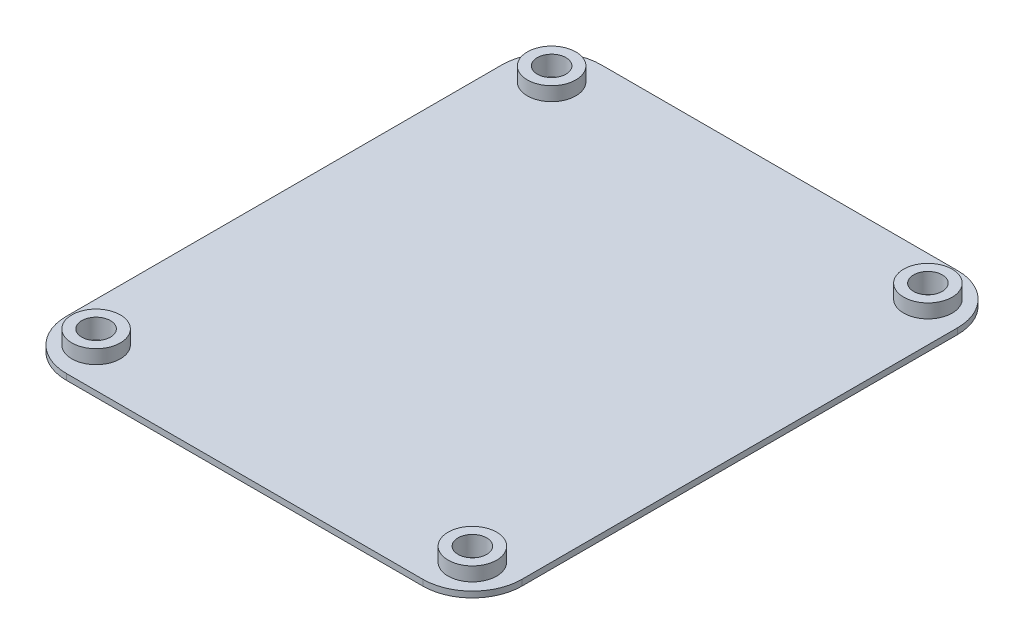
ISO-10303-21;
HEADER;
FILE_DESCRIPTION(('STEP AP214'),'2;1');
FILE_NAME('part.step','',(''),(''),'','','');
FILE_SCHEMA(('AUTOMOTIVE_DESIGN { 1 0 10303 214 1 1 1 1 }'));
ENDSEC;
DATA;
#1=APPLICATION_CONTEXT('core data for automotive mechanical design processes');
#2=APPLICATION_PROTOCOL_DEFINITION('international standard','automotive_design',2000,#1);
#3=PRODUCT_CONTEXT('',#1,'mechanical');
#4=PRODUCT('Part','Part','',(#3));
#5=PRODUCT_RELATED_PRODUCT_CATEGORY('part','',(#4));
#6=PRODUCT_DEFINITION_FORMATION('','',#4);
#7=PRODUCT_DEFINITION_CONTEXT('part definition',#1,'design');
#8=PRODUCT_DEFINITION('design','',#6,#7);
#9=PRODUCT_DEFINITION_SHAPE('','',#8);
#10=(LENGTH_UNIT() NAMED_UNIT(*) SI_UNIT(.MILLI.,.METRE.));
#11=(NAMED_UNIT(*) PLANE_ANGLE_UNIT() SI_UNIT($,.RADIAN.));
#12=(NAMED_UNIT(*) SI_UNIT($,.STERADIAN.) SOLID_ANGLE_UNIT());
#13=UNCERTAINTY_MEASURE_WITH_UNIT(LENGTH_MEASURE(1.E-05),#10,'distance_accuracy_value','');
#14=(GEOMETRIC_REPRESENTATION_CONTEXT(3) GLOBAL_UNCERTAINTY_ASSIGNED_CONTEXT((#13)) GLOBAL_UNIT_ASSIGNED_CONTEXT((#10,
#11,#12)) REPRESENTATION_CONTEXT('',''));
#15=CARTESIAN_POINT('',(0.,0.,0.));
#16=DIRECTION('',(0.,0.,1.));
#17=DIRECTION('',(1.,0.,0.));
#18=AXIS2_PLACEMENT_3D('',#15,#16,#17);
#19=CARTESIAN_POINT('',(0.,0.6,-27.));
#20=DIRECTION('',(0.,0.,-1.));
#21=DIRECTION('',(-1.,0.,0.));
#22=AXIS2_PLACEMENT_3D('',#19,#20,#21);
#23=PLANE('',#22);
#24=DIRECTION('',(1.,0.,0.));
#25=VECTOR('',#24,1.);
#26=CARTESIAN_POINT('',(0.,0.,-27.));
#27=LINE('',#26,#25);
#28=CARTESIAN_POINT('',(-18.,0.,-27.));
#29=VERTEX_POINT('',#28);
#30=CARTESIAN_POINT('',(18.,0.,-27.));
#31=VERTEX_POINT('',#30);
#32=EDGE_CURVE('E131',#29,#31,#27,.T.);
#33=ORIENTED_EDGE('',*,*,#32,.F.);
#34=DIRECTION('',(0.,-1.,0.));
#35=VECTOR('',#34,1.);
#36=CARTESIAN_POINT('',(-18.,0.6,-27.));
#37=LINE('',#36,#35);
#38=CARTESIAN_POINT('',(-18.,0.6,-27.));
#39=VERTEX_POINT('',#38);
#40=EDGE_CURVE('E107',#29,#39,#37,.F.);
#41=ORIENTED_EDGE('',*,*,#40,.T.);
#42=DIRECTION('',(1.,0.,0.));
#43=VECTOR('',#42,1.);
#44=CARTESIAN_POINT('',(0.,0.6,-27.));
#45=LINE('',#44,#43);
#46=CARTESIAN_POINT('',(18.,0.6,-27.));
#47=VERTEX_POINT('',#46);
#48=EDGE_CURVE('E154',#39,#47,#45,.T.);
#49=ORIENTED_EDGE('',*,*,#48,.T.);
#50=DIRECTION('',(0.,-1.,0.));
#51=VECTOR('',#50,1.);
#52=CARTESIAN_POINT('',(18.,0.6,-27.));
#53=LINE('',#52,#51);
#54=EDGE_CURVE('E112',#47,#31,#53,.T.);
#55=ORIENTED_EDGE('',*,*,#54,.T.);
#56=EDGE_LOOP('',(#33,#41,#49,#55));
#57=FACE_BOUND('',#56,.T.);
#58=ADVANCED_FACE('F35',(#57),#23,.T.);
#59=CARTESIAN_POINT('',(-23.,0.6,0.));
#60=DIRECTION('',(1.,0.,0.));
#61=DIRECTION('',(0.,0.,-1.));
#62=AXIS2_PLACEMENT_3D('',#59,#60,#61);
#63=PLANE('',#62);
#64=DIRECTION('',(0.,0.,1.));
#65=VECTOR('',#64,1.);
#66=CARTESIAN_POINT('',(-23.,0.6,0.));
#67=LINE('',#66,#65);
#68=CARTESIAN_POINT('',(-23.,0.6,-22.));
#69=VERTEX_POINT('',#68);
#70=CARTESIAN_POINT('',(-23.,0.6,22.));
#71=VERTEX_POINT('',#70);
#72=EDGE_CURVE('E122',#69,#71,#67,.T.);
#73=ORIENTED_EDGE('',*,*,#72,.F.);
#74=DIRECTION('',(0.,-1.,0.));
#75=VECTOR('',#74,1.);
#76=CARTESIAN_POINT('',(-23.,0.,-22.));
#77=LINE('',#76,#75);
#78=CARTESIAN_POINT('',(-23.,0.,-22.));
#79=VERTEX_POINT('',#78);
#80=EDGE_CURVE('E106',#69,#79,#77,.T.);
#81=ORIENTED_EDGE('',*,*,#80,.T.);
#82=DIRECTION('',(0.,0.,1.));
#83=VECTOR('',#82,1.);
#84=CARTESIAN_POINT('',(-23.,0.,0.));
#85=LINE('',#84,#83);
#86=CARTESIAN_POINT('',(-23.,0.,22.));
#87=VERTEX_POINT('',#86);
#88=EDGE_CURVE('E119',#79,#87,#85,.T.);
#89=ORIENTED_EDGE('',*,*,#88,.T.);
#90=DIRECTION('',(0.,-1.,0.));
#91=VECTOR('',#90,1.);
#92=CARTESIAN_POINT('',(-23.,0.6,22.));
#93=LINE('',#92,#91);
#94=EDGE_CURVE('E124',#87,#71,#93,.F.);
#95=ORIENTED_EDGE('',*,*,#94,.T.);
#96=EDGE_LOOP('',(#73,#81,#89,#95));
#97=FACE_BOUND('',#96,.T.);
#98=ADVANCED_FACE('F118',(#97),#63,.F.);
#99=CARTESIAN_POINT('',(0.,0.6,27.));
#100=DIRECTION('',(0.,0.,-1.));
#101=DIRECTION('',(-1.,0.,0.));
#102=AXIS2_PLACEMENT_3D('',#99,#100,#101);
#103=PLANE('',#102);
#104=DIRECTION('',(1.,0.,0.));
#105=VECTOR('',#104,1.);
#106=CARTESIAN_POINT('',(0.,0.6,27.));
#107=LINE('',#106,#105);
#108=CARTESIAN_POINT('',(-18.,0.6,27.));
#109=VERTEX_POINT('',#108);
#110=CARTESIAN_POINT('',(18.,0.6,27.));
#111=VERTEX_POINT('',#110);
#112=EDGE_CURVE('E177',#109,#111,#107,.T.);
#113=ORIENTED_EDGE('',*,*,#112,.F.);
#114=DIRECTION('',(0.,-1.,0.));
#115=VECTOR('',#114,1.);
#116=CARTESIAN_POINT('',(-18.,0.6,27.));
#117=LINE('',#116,#115);
#118=CARTESIAN_POINT('',(-18.,0.,27.));
#119=VERTEX_POINT('',#118);
#120=EDGE_CURVE('E11',#109,#119,#117,.T.);
#121=ORIENTED_EDGE('',*,*,#120,.T.);
#122=DIRECTION('',(1.,0.,0.));
#123=VECTOR('',#122,1.);
#124=CARTESIAN_POINT('',(0.,0.,27.));
#125=LINE('',#124,#123);
#126=CARTESIAN_POINT('',(18.,0.,27.));
#127=VERTEX_POINT('',#126);
#128=EDGE_CURVE('E130',#119,#127,#125,.T.);
#129=ORIENTED_EDGE('',*,*,#128,.T.);
#130=DIRECTION('',(0.,-1.,0.));
#131=VECTOR('',#130,1.);
#132=CARTESIAN_POINT('',(18.,0.6,27.));
#133=LINE('',#132,#131);
#134=EDGE_CURVE('E43',#127,#111,#133,.F.);
#135=ORIENTED_EDGE('',*,*,#134,.T.);
#136=EDGE_LOOP('',(#113,#121,#129,#135));
#137=FACE_BOUND('',#136,.T.);
#138=ADVANCED_FACE('F176',(#137),#103,.F.);
#139=CARTESIAN_POINT('',(-19.,0.6,23.));
#140=DIRECTION('',(0.,-1.,0.));
#141=DIRECTION('',(0.,0.,-1.));
#142=AXIS2_PLACEMENT_3D('',#139,#140,#141);
#143=CYLINDRICAL_SURFACE('',#142,1.45);
#144=CARTESIAN_POINT('',(-19.,0.,23.));
#145=DIRECTION('',(0.,1.,0.));
#146=DIRECTION('',(0.,0.,1.));
#147=AXIS2_PLACEMENT_3D('',#144,#145,#146);
#148=CIRCLE('',#147,1.45);
#149=CARTESIAN_POINT('',(-19.,0.,24.45));
#150=VERTEX_POINT('',#149);
#151=EDGE_CURVE('E148',#150,#150,#148,.T.);
#152=ORIENTED_EDGE('',*,*,#151,.F.);
#153=EDGE_LOOP('',(#152));
#154=FACE_BOUND('',#153,.T.);
#155=CARTESIAN_POINT('',(-19.,2.,23.));
#156=DIRECTION('',(0.,1.,0.));
#157=DIRECTION('',(0.,0.,1.));
#158=AXIS2_PLACEMENT_3D('',#155,#156,#157);
#159=CIRCLE('',#158,1.45);
#160=CARTESIAN_POINT('',(-19.,2.,24.45));
#161=VERTEX_POINT('',#160);
#162=EDGE_CURVE('E200',#161,#161,#159,.T.);
#163=ORIENTED_EDGE('',*,*,#162,.T.);
#164=EDGE_LOOP('',(#163));
#165=FACE_BOUND('',#164,.T.);
#166=ADVANCED_FACE('F333',(#154,#165),#143,.F.);
#167=CARTESIAN_POINT('',(19.,0.6,-23.));
#168=DIRECTION('',(0.,-1.,0.));
#169=DIRECTION('',(0.,0.,-1.));
#170=AXIS2_PLACEMENT_3D('',#167,#168,#169);
#171=CYLINDRICAL_SURFACE('',#170,1.45);
#172=CARTESIAN_POINT('',(19.,0.,-23.));
#173=DIRECTION('',(0.,1.,0.));
#174=DIRECTION('',(0.,0.,1.));
#175=AXIS2_PLACEMENT_3D('',#172,#173,#174);
#176=CIRCLE('',#175,1.45);
#177=CARTESIAN_POINT('',(19.,0.,-21.55));
#178=VERTEX_POINT('',#177);
#179=EDGE_CURVE('E145',#178,#178,#176,.T.);
#180=ORIENTED_EDGE('',*,*,#179,.F.);
#181=EDGE_LOOP('',(#180));
#182=FACE_BOUND('',#181,.T.);
#183=CARTESIAN_POINT('',(19.,2.,-23.));
#184=DIRECTION('',(0.,1.,0.));
#185=DIRECTION('',(0.,0.,1.));
#186=AXIS2_PLACEMENT_3D('',#183,#184,#185);
#187=CIRCLE('',#186,1.45);
#188=CARTESIAN_POINT('',(19.,2.,-21.55));
#189=VERTEX_POINT('',#188);
#190=EDGE_CURVE('E227',#189,#189,#187,.T.);
#191=ORIENTED_EDGE('',*,*,#190,.T.);
#192=EDGE_LOOP('',(#191));
#193=FACE_BOUND('',#192,.T.);
#194=ADVANCED_FACE('F231',(#182,#193),#171,.F.);
#195=CARTESIAN_POINT('',(-19.,0.6,-23.));
#196=DIRECTION('',(0.,-1.,0.));
#197=DIRECTION('',(0.,0.,-1.));
#198=AXIS2_PLACEMENT_3D('',#195,#196,#197);
#199=CYLINDRICAL_SURFACE('',#198,1.45);
#200=CARTESIAN_POINT('',(-19.,0.,-23.));
#201=DIRECTION('',(0.,1.,0.));
#202=DIRECTION('',(0.,0.,1.));
#203=AXIS2_PLACEMENT_3D('',#200,#201,#202);
#204=CIRCLE('',#203,1.45);
#205=CARTESIAN_POINT('',(-19.,0.,-21.55));
#206=VERTEX_POINT('',#205);
#207=EDGE_CURVE('E142',#206,#206,#204,.T.);
#208=ORIENTED_EDGE('',*,*,#207,.F.);
#209=EDGE_LOOP('',(#208));
#210=FACE_BOUND('',#209,.T.);
#211=CARTESIAN_POINT('',(-19.,2.,-23.));
#212=DIRECTION('',(0.,1.,0.));
#213=DIRECTION('',(0.,0.,1.));
#214=AXIS2_PLACEMENT_3D('',#211,#212,#213);
#215=CIRCLE('',#214,1.45);
#216=CARTESIAN_POINT('',(-19.,2.,-21.55));
#217=VERTEX_POINT('',#216);
#218=EDGE_CURVE('E218',#217,#217,#215,.T.);
#219=ORIENTED_EDGE('',*,*,#218,.T.);
#220=EDGE_LOOP('',(#219));
#221=FACE_BOUND('',#220,.T.);
#222=ADVANCED_FACE('F321',(#210,#221),#199,.F.);
#223=CARTESIAN_POINT('',(23.,0.6,0.));
#224=DIRECTION('',(1.,0.,0.));
#225=DIRECTION('',(0.,0.,-1.));
#226=AXIS2_PLACEMENT_3D('',#223,#224,#225);
#227=PLANE('',#226);
#228=DIRECTION('',(0.,0.,1.));
#229=VECTOR('',#228,1.);
#230=CARTESIAN_POINT('',(23.,0.,0.));
#231=LINE('',#230,#229);
#232=CARTESIAN_POINT('',(23.,0.,-22.));
#233=VERTEX_POINT('',#232);
#234=CARTESIAN_POINT('',(23.,0.,22.));
#235=VERTEX_POINT('',#234);
#236=EDGE_CURVE('E134',#233,#235,#231,.T.);
#237=ORIENTED_EDGE('',*,*,#236,.F.);
#238=DIRECTION('',(0.,-1.,0.));
#239=VECTOR('',#238,1.);
#240=CARTESIAN_POINT('',(23.,0.6,-22.));
#241=LINE('',#240,#239);
#242=CARTESIAN_POINT('',(23.,0.6,-22.));
#243=VERTEX_POINT('',#242);
#244=EDGE_CURVE('E57',#233,#243,#241,.F.);
#245=ORIENTED_EDGE('',*,*,#244,.T.);
#246=DIRECTION('',(0.,0.,1.));
#247=VECTOR('',#246,1.);
#248=CARTESIAN_POINT('',(23.,0.6,0.));
#249=LINE('',#248,#247);
#250=CARTESIAN_POINT('',(23.,0.6,22.));
#251=VERTEX_POINT('',#250);
#252=EDGE_CURVE('E155',#243,#251,#249,.T.);
#253=ORIENTED_EDGE('',*,*,#252,.T.);
#254=DIRECTION('',(0.,-1.,0.));
#255=VECTOR('',#254,1.);
#256=CARTESIAN_POINT('',(23.,0.,22.));
#257=LINE('',#256,#255);
#258=EDGE_CURVE('E170',#251,#235,#257,.T.);
#259=ORIENTED_EDGE('',*,*,#258,.T.);
#260=EDGE_LOOP('',(#237,#245,#253,#259));
#261=FACE_BOUND('',#260,.T.);
#262=ADVANCED_FACE('F185',(#261),#227,.T.);
#263=CARTESIAN_POINT('',(19.,0.6,23.));
#264=DIRECTION('',(0.,-1.,0.));
#265=DIRECTION('',(0.,0.,-1.));
#266=AXIS2_PLACEMENT_3D('',#263,#264,#265);
#267=CYLINDRICAL_SURFACE('',#266,1.45);
#268=CARTESIAN_POINT('',(19.,0.,23.));
#269=DIRECTION('',(0.,1.,0.));
#270=DIRECTION('',(0.,0.,1.));
#271=AXIS2_PLACEMENT_3D('',#268,#269,#270);
#272=CIRCLE('',#271,1.45);
#273=CARTESIAN_POINT('',(19.,0.,24.45));
#274=VERTEX_POINT('',#273);
#275=EDGE_CURVE('E151',#274,#274,#272,.T.);
#276=ORIENTED_EDGE('',*,*,#275,.F.);
#277=EDGE_LOOP('',(#276));
#278=FACE_BOUND('',#277,.T.);
#279=CARTESIAN_POINT('',(19.,2.,23.));
#280=DIRECTION('',(0.,1.,0.));
#281=DIRECTION('',(0.,0.,1.));
#282=AXIS2_PLACEMENT_3D('',#279,#280,#281);
#283=CIRCLE('',#282,1.45);
#284=CARTESIAN_POINT('',(19.,2.,24.45));
#285=VERTEX_POINT('',#284);
#286=EDGE_CURVE('E209',#285,#285,#283,.T.);
#287=ORIENTED_EDGE('',*,*,#286,.T.);
#288=EDGE_LOOP('',(#287));
#289=FACE_BOUND('',#288,.T.);
#290=ADVANCED_FACE('F308',(#278,#289),#267,.F.);
#291=CARTESIAN_POINT('',(0.,0.6,0.));
#292=DIRECTION('',(0.,1.,0.));
#293=DIRECTION('',(0.,0.,1.));
#294=AXIS2_PLACEMENT_3D('',#291,#292,#293);
#295=PLANE('',#294);
#296=CARTESIAN_POINT('',(19.,0.6,-23.));
#297=DIRECTION('',(0.,1.,0.));
#298=DIRECTION('',(0.,0.,1.));
#299=AXIS2_PLACEMENT_3D('',#296,#297,#298);
#300=CIRCLE('',#299,2.45);
#301=CARTESIAN_POINT('',(19.,0.6,-20.55));
#302=VERTEX_POINT('',#301);
#303=EDGE_CURVE('E221',#302,#302,#300,.F.);
#304=ORIENTED_EDGE('',*,*,#303,.T.);
#305=EDGE_LOOP('',(#304));
#306=FACE_BOUND('',#305,.T.);
#307=CARTESIAN_POINT('',(-19.,0.6,-23.));
#308=DIRECTION('',(0.,1.,0.));
#309=DIRECTION('',(0.,0.,1.));
#310=AXIS2_PLACEMENT_3D('',#307,#308,#309);
#311=CIRCLE('',#310,2.45);
#312=CARTESIAN_POINT('',(-19.,0.6,-20.55));
#313=VERTEX_POINT('',#312);
#314=EDGE_CURVE('E212',#313,#313,#311,.F.);
#315=ORIENTED_EDGE('',*,*,#314,.T.);
#316=EDGE_LOOP('',(#315));
#317=FACE_BOUND('',#316,.T.);
#318=CARTESIAN_POINT('',(19.,0.6,23.));
#319=DIRECTION('',(0.,1.,0.));
#320=DIRECTION('',(0.,0.,1.));
#321=AXIS2_PLACEMENT_3D('',#318,#319,#320);
#322=CIRCLE('',#321,2.45);
#323=CARTESIAN_POINT('',(19.,0.6,25.45));
#324=VERTEX_POINT('',#323);
#325=EDGE_CURVE('E203',#324,#324,#322,.F.);
#326=ORIENTED_EDGE('',*,*,#325,.T.);
#327=EDGE_LOOP('',(#326));
#328=FACE_BOUND('',#327,.T.);
#329=CARTESIAN_POINT('',(-19.,0.6,23.));
#330=DIRECTION('',(0.,1.,0.));
#331=DIRECTION('',(0.,0.,1.));
#332=AXIS2_PLACEMENT_3D('',#329,#330,#331);
#333=CIRCLE('',#332,2.45);
#334=CARTESIAN_POINT('',(-19.,0.6,25.45));
#335=VERTEX_POINT('',#334);
#336=EDGE_CURVE('E136',#335,#335,#333,.F.);
#337=ORIENTED_EDGE('',*,*,#336,.T.);
#338=EDGE_LOOP('',(#337));
#339=FACE_BOUND('',#338,.T.);
#340=ORIENTED_EDGE('',*,*,#48,.F.);
#341=CARTESIAN_POINT('',(-18.,0.6,-22.));
#342=DIRECTION('',(0.,1.,0.));
#343=DIRECTION('',(0.,0.,1.));
#344=AXIS2_PLACEMENT_3D('',#341,#342,#343);
#345=CIRCLE('',#344,5.);
#346=EDGE_CURVE('E168',#39,#69,#345,.T.);
#347=ORIENTED_EDGE('',*,*,#346,.T.);
#348=ORIENTED_EDGE('',*,*,#72,.T.);
#349=CARTESIAN_POINT('',(-18.,0.6,22.));
#350=DIRECTION('',(0.,1.,0.));
#351=DIRECTION('',(0.,0.,1.));
#352=AXIS2_PLACEMENT_3D('',#349,#350,#351);
#353=CIRCLE('',#352,5.);
#354=EDGE_CURVE('E164',#71,#109,#353,.T.);
#355=ORIENTED_EDGE('',*,*,#354,.T.);
#356=ORIENTED_EDGE('',*,*,#112,.T.);
#357=CARTESIAN_POINT('',(18.,0.6,22.));
#358=DIRECTION('',(0.,1.,0.));
#359=DIRECTION('',(0.,0.,1.));
#360=AXIS2_PLACEMENT_3D('',#357,#358,#359);
#361=CIRCLE('',#360,5.);
#362=EDGE_CURVE('E50',#111,#251,#361,.T.);
#363=ORIENTED_EDGE('',*,*,#362,.T.);
#364=ORIENTED_EDGE('',*,*,#252,.F.);
#365=CARTESIAN_POINT('',(18.,0.6,-22.));
#366=DIRECTION('',(0.,1.,0.));
#367=DIRECTION('',(0.,0.,1.));
#368=AXIS2_PLACEMENT_3D('',#365,#366,#367);
#369=CIRCLE('',#368,5.);
#370=EDGE_CURVE('E166',#243,#47,#369,.T.);
#371=ORIENTED_EDGE('',*,*,#370,.T.);
#372=EDGE_LOOP('',(#340,#347,#348,#355,#356,#363,#364,#371));
#373=FACE_BOUND('',#372,.T.);
#374=ADVANCED_FACE('F181',(#306,#317,#328,#339,#373),#295,.T.);
#375=CARTESIAN_POINT('',(0.,0.,0.));
#376=DIRECTION('',(0.,1.,0.));
#377=DIRECTION('',(0.,0.,1.));
#378=AXIS2_PLACEMENT_3D('',#375,#376,#377);
#379=PLANE('',#378);
#380=ORIENTED_EDGE('',*,*,#88,.F.);
#381=CARTESIAN_POINT('',(-18.,0.,-22.));
#382=DIRECTION('',(0.,1.,0.));
#383=DIRECTION('',(0.,0.,1.));
#384=AXIS2_PLACEMENT_3D('',#381,#382,#383);
#385=CIRCLE('',#384,5.);
#386=EDGE_CURVE('E102',#79,#29,#385,.F.);
#387=ORIENTED_EDGE('',*,*,#386,.T.);
#388=ORIENTED_EDGE('',*,*,#32,.T.);
#389=CARTESIAN_POINT('',(18.,0.,-22.));
#390=DIRECTION('',(0.,1.,0.));
#391=DIRECTION('',(0.,0.,1.));
#392=AXIS2_PLACEMENT_3D('',#389,#390,#391);
#393=CIRCLE('',#392,5.);
#394=EDGE_CURVE('E113',#31,#233,#393,.F.);
#395=ORIENTED_EDGE('',*,*,#394,.T.);
#396=ORIENTED_EDGE('',*,*,#236,.T.);
#397=CARTESIAN_POINT('',(18.,0.,22.));
#398=DIRECTION('',(0.,1.,0.));
#399=DIRECTION('',(0.,0.,1.));
#400=AXIS2_PLACEMENT_3D('',#397,#398,#399);
#401=CIRCLE('',#400,5.);
#402=EDGE_CURVE('E123',#235,#127,#401,.F.);
#403=ORIENTED_EDGE('',*,*,#402,.T.);
#404=ORIENTED_EDGE('',*,*,#128,.F.);
#405=CARTESIAN_POINT('',(-18.,0.,22.));
#406=DIRECTION('',(0.,1.,0.));
#407=DIRECTION('',(0.,0.,1.));
#408=AXIS2_PLACEMENT_3D('',#405,#406,#407);
#409=CIRCLE('',#408,5.);
#410=EDGE_CURVE('E129',#119,#87,#409,.F.);
#411=ORIENTED_EDGE('',*,*,#410,.T.);
#412=EDGE_LOOP('',(#380,#387,#388,#395,#396,#403,#404,#411));
#413=FACE_BOUND('',#412,.T.);
#414=ORIENTED_EDGE('',*,*,#151,.T.);
#415=EDGE_LOOP('',(#414));
#416=FACE_BOUND('',#415,.T.);
#417=ORIENTED_EDGE('',*,*,#275,.T.);
#418=EDGE_LOOP('',(#417));
#419=FACE_BOUND('',#418,.T.);
#420=ORIENTED_EDGE('',*,*,#207,.T.);
#421=EDGE_LOOP('',(#420));
#422=FACE_BOUND('',#421,.T.);
#423=ORIENTED_EDGE('',*,*,#179,.T.);
#424=EDGE_LOOP('',(#423));
#425=FACE_BOUND('',#424,.T.);
#426=ADVANCED_FACE('F126',(#413,#416,#419,#422,#425),#379,.F.);
#427=CARTESIAN_POINT('',(-19.,2.,23.));
#428=DIRECTION('',(0.,-1.,0.));
#429=DIRECTION('',(0.,0.,-1.));
#430=AXIS2_PLACEMENT_3D('',#427,#428,#429);
#431=CYLINDRICAL_SURFACE('',#430,2.45);
#432=ORIENTED_EDGE('',*,*,#336,.F.);
#433=EDGE_LOOP('',(#432));
#434=FACE_BOUND('',#433,.T.);
#435=CARTESIAN_POINT('',(-19.,2.,23.));
#436=DIRECTION('',(0.,1.,0.));
#437=DIRECTION('',(0.,0.,1.));
#438=AXIS2_PLACEMENT_3D('',#435,#436,#437);
#439=CIRCLE('',#438,2.45);
#440=CARTESIAN_POINT('',(-19.,2.,25.45));
#441=VERTEX_POINT('',#440);
#442=EDGE_CURVE('E197',#441,#441,#439,.T.);
#443=ORIENTED_EDGE('',*,*,#442,.F.);
#444=EDGE_LOOP('',(#443));
#445=FACE_BOUND('',#444,.T.);
#446=ADVANCED_FACE('F296',(#434,#445),#431,.T.);
#447=CARTESIAN_POINT('',(0.,2.,0.));
#448=DIRECTION('',(0.,1.,0.));
#449=DIRECTION('',(0.,0.,1.));
#450=AXIS2_PLACEMENT_3D('',#447,#448,#449);
#451=PLANE('',#450);
#452=ORIENTED_EDGE('',*,*,#162,.F.);
#453=EDGE_LOOP('',(#452));
#454=FACE_BOUND('',#453,.T.);
#455=ORIENTED_EDGE('',*,*,#442,.T.);
#456=EDGE_LOOP('',(#455));
#457=FACE_BOUND('',#456,.T.);
#458=ADVANCED_FACE('F388',(#454,#457),#451,.T.);
#459=CARTESIAN_POINT('',(19.,2.,23.));
#460=DIRECTION('',(0.,-1.,0.));
#461=DIRECTION('',(0.,0.,-1.));
#462=AXIS2_PLACEMENT_3D('',#459,#460,#461);
#463=CYLINDRICAL_SURFACE('',#462,2.45);
#464=ORIENTED_EDGE('',*,*,#325,.F.);
#465=EDGE_LOOP('',(#464));
#466=FACE_BOUND('',#465,.T.);
#467=CARTESIAN_POINT('',(19.,2.,23.));
#468=DIRECTION('',(0.,1.,0.));
#469=DIRECTION('',(0.,0.,1.));
#470=AXIS2_PLACEMENT_3D('',#467,#468,#469);
#471=CIRCLE('',#470,2.45);
#472=CARTESIAN_POINT('',(19.,2.,25.45));
#473=VERTEX_POINT('',#472);
#474=EDGE_CURVE('E206',#473,#473,#471,.T.);
#475=ORIENTED_EDGE('',*,*,#474,.F.);
#476=EDGE_LOOP('',(#475));
#477=FACE_BOUND('',#476,.T.);
#478=ADVANCED_FACE('F378',(#466,#477),#463,.T.);
#479=CARTESIAN_POINT('',(0.,2.,0.));
#480=DIRECTION('',(0.,1.,0.));
#481=DIRECTION('',(0.,0.,1.));
#482=AXIS2_PLACEMENT_3D('',#479,#480,#481);
#483=PLANE('',#482);
#484=ORIENTED_EDGE('',*,*,#286,.F.);
#485=EDGE_LOOP('',(#484));
#486=FACE_BOUND('',#485,.T.);
#487=ORIENTED_EDGE('',*,*,#474,.T.);
#488=EDGE_LOOP('',(#487));
#489=FACE_BOUND('',#488,.T.);
#490=ADVANCED_FACE('F368',(#486,#489),#483,.T.);
#491=CARTESIAN_POINT('',(-19.,2.,-23.));
#492=DIRECTION('',(0.,-1.,0.));
#493=DIRECTION('',(0.,0.,-1.));
#494=AXIS2_PLACEMENT_3D('',#491,#492,#493);
#495=CYLINDRICAL_SURFACE('',#494,2.45);
#496=ORIENTED_EDGE('',*,*,#314,.F.);
#497=EDGE_LOOP('',(#496));
#498=FACE_BOUND('',#497,.T.);
#499=CARTESIAN_POINT('',(-19.,2.,-23.));
#500=DIRECTION('',(0.,1.,0.));
#501=DIRECTION('',(0.,0.,1.));
#502=AXIS2_PLACEMENT_3D('',#499,#500,#501);
#503=CIRCLE('',#502,2.45);
#504=CARTESIAN_POINT('',(-19.,2.,-20.55));
#505=VERTEX_POINT('',#504);
#506=EDGE_CURVE('E215',#505,#505,#503,.T.);
#507=ORIENTED_EDGE('',*,*,#506,.F.);
#508=EDGE_LOOP('',(#507));
#509=FACE_BOUND('',#508,.T.);
#510=ADVANCED_FACE('F247',(#498,#509),#495,.T.);
#511=CARTESIAN_POINT('',(0.,2.,0.));
#512=DIRECTION('',(0.,1.,0.));
#513=DIRECTION('',(0.,0.,1.));
#514=AXIS2_PLACEMENT_3D('',#511,#512,#513);
#515=PLANE('',#514);
#516=ORIENTED_EDGE('',*,*,#218,.F.);
#517=EDGE_LOOP('',(#516));
#518=FACE_BOUND('',#517,.T.);
#519=ORIENTED_EDGE('',*,*,#506,.T.);
#520=EDGE_LOOP('',(#519));
#521=FACE_BOUND('',#520,.T.);
#522=ADVANCED_FACE('F241',(#518,#521),#515,.T.);
#523=CARTESIAN_POINT('',(19.,2.,-23.));
#524=DIRECTION('',(0.,-1.,0.));
#525=DIRECTION('',(0.,0.,-1.));
#526=AXIS2_PLACEMENT_3D('',#523,#524,#525);
#527=CYLINDRICAL_SURFACE('',#526,2.45);
#528=ORIENTED_EDGE('',*,*,#303,.F.);
#529=EDGE_LOOP('',(#528));
#530=FACE_BOUND('',#529,.T.);
#531=CARTESIAN_POINT('',(19.,2.,-23.));
#532=DIRECTION('',(0.,1.,0.));
#533=DIRECTION('',(0.,0.,1.));
#534=AXIS2_PLACEMENT_3D('',#531,#532,#533);
#535=CIRCLE('',#534,2.45);
#536=CARTESIAN_POINT('',(19.,2.,-20.55));
#537=VERTEX_POINT('',#536);
#538=EDGE_CURVE('E224',#537,#537,#535,.T.);
#539=ORIENTED_EDGE('',*,*,#538,.F.);
#540=EDGE_LOOP('',(#539));
#541=FACE_BOUND('',#540,.T.);
#542=ADVANCED_FACE('F236',(#530,#541),#527,.T.);
#543=CARTESIAN_POINT('',(0.,2.,0.));
#544=DIRECTION('',(0.,1.,0.));
#545=DIRECTION('',(0.,0.,1.));
#546=AXIS2_PLACEMENT_3D('',#543,#544,#545);
#547=PLANE('',#546);
#548=ORIENTED_EDGE('',*,*,#190,.F.);
#549=EDGE_LOOP('',(#548));
#550=FACE_BOUND('',#549,.T.);
#551=ORIENTED_EDGE('',*,*,#538,.T.);
#552=EDGE_LOOP('',(#551));
#553=FACE_BOUND('',#552,.T.);
#554=ADVANCED_FACE('F233',(#550,#553),#547,.T.);
#555=CARTESIAN_POINT('',(-18.,0.6,-22.));
#556=DIRECTION('',(0.,1.,0.));
#557=DIRECTION('',(0.,0.,1.));
#558=AXIS2_PLACEMENT_3D('',#555,#556,#557);
#559=CYLINDRICAL_SURFACE('',#558,5.);
#560=ORIENTED_EDGE('',*,*,#346,.F.);
#561=ORIENTED_EDGE('',*,*,#40,.F.);
#562=ORIENTED_EDGE('',*,*,#386,.F.);
#563=ORIENTED_EDGE('',*,*,#80,.F.);
#564=EDGE_LOOP('',(#560,#561,#562,#563));
#565=FACE_BOUND('',#564,.T.);
#566=ADVANCED_FACE('F105',(#565),#559,.T.);
#567=CARTESIAN_POINT('',(18.,0.6,-22.));
#568=DIRECTION('',(0.,-1.,0.));
#569=DIRECTION('',(0.,0.,-1.));
#570=AXIS2_PLACEMENT_3D('',#567,#568,#569);
#571=CYLINDRICAL_SURFACE('',#570,5.);
#572=ORIENTED_EDGE('',*,*,#370,.F.);
#573=ORIENTED_EDGE('',*,*,#244,.F.);
#574=ORIENTED_EDGE('',*,*,#394,.F.);
#575=ORIENTED_EDGE('',*,*,#54,.F.);
#576=EDGE_LOOP('',(#572,#573,#574,#575));
#577=FACE_BOUND('',#576,.T.);
#578=ADVANCED_FACE('F189',(#577),#571,.T.);
#579=CARTESIAN_POINT('',(-18.,0.6,22.));
#580=DIRECTION('',(0.,-1.,0.));
#581=DIRECTION('',(0.,0.,-1.));
#582=AXIS2_PLACEMENT_3D('',#579,#580,#581);
#583=CYLINDRICAL_SURFACE('',#582,5.);
#584=ORIENTED_EDGE('',*,*,#354,.F.);
#585=ORIENTED_EDGE('',*,*,#94,.F.);
#586=ORIENTED_EDGE('',*,*,#410,.F.);
#587=ORIENTED_EDGE('',*,*,#120,.F.);
#588=EDGE_LOOP('',(#584,#585,#586,#587));
#589=FACE_BOUND('',#588,.T.);
#590=ADVANCED_FACE('F262',(#589),#583,.T.);
#591=CARTESIAN_POINT('',(18.,0.6,22.));
#592=DIRECTION('',(0.,1.,0.));
#593=DIRECTION('',(0.,0.,1.));
#594=AXIS2_PLACEMENT_3D('',#591,#592,#593);
#595=CYLINDRICAL_SURFACE('',#594,5.);
#596=ORIENTED_EDGE('',*,*,#362,.F.);
#597=ORIENTED_EDGE('',*,*,#134,.F.);
#598=ORIENTED_EDGE('',*,*,#402,.F.);
#599=ORIENTED_EDGE('',*,*,#258,.F.);
#600=EDGE_LOOP('',(#596,#597,#598,#599));
#601=FACE_BOUND('',#600,.T.);
#602=ADVANCED_FACE('F37',(#601),#595,.T.);
#603=CLOSED_SHELL('',(#58,#98,#138,#166,#194,#222,#262,#290,#374,#426,#446,#458,#478,#490,#510,
#522,#542,#554,#566,#578,#590,#602));
#604=MANIFOLD_SOLID_BREP('B2',#603);
#605=ADVANCED_BREP_SHAPE_REPRESENTATION('',(#18,#604),#14);
#606=SHAPE_DEFINITION_REPRESENTATION(#9,#605);
ENDSEC;
END-ISO-10303-21;
